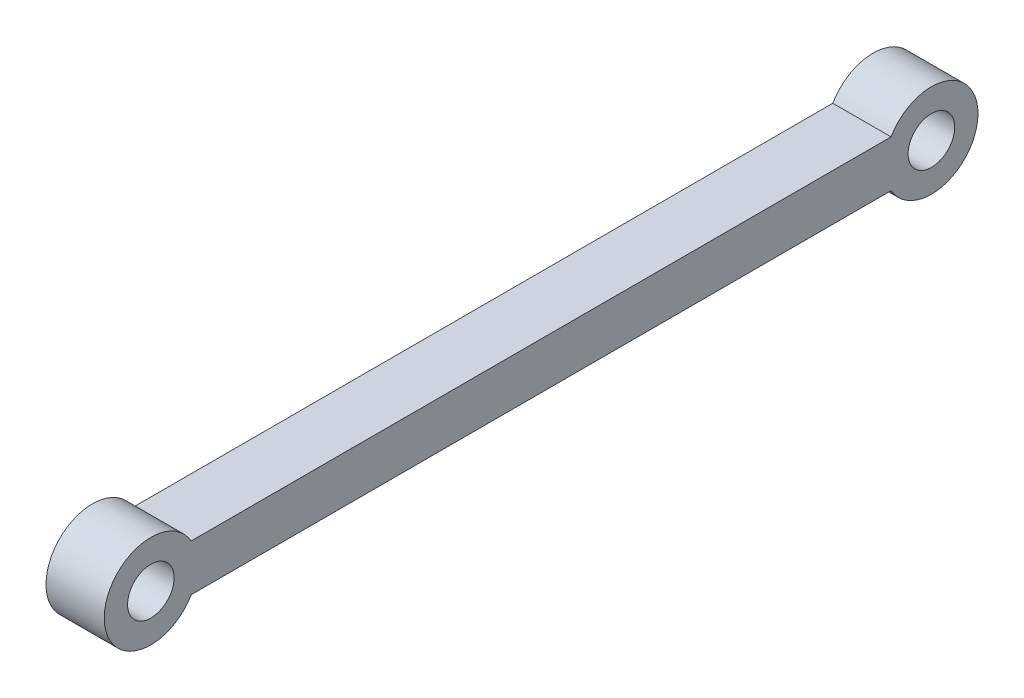
ISO-10303-21;
HEADER;
FILE_DESCRIPTION(('STEP AP214'),'2;1');
FILE_NAME('part.step','',(''),(''),'','','');
FILE_SCHEMA(('AUTOMOTIVE_DESIGN { 1 0 10303 214 1 1 1 1 }'));
ENDSEC;
DATA;
#1=APPLICATION_CONTEXT('core data for automotive mechanical design processes');
#2=APPLICATION_PROTOCOL_DEFINITION('international standard','automotive_design',2000,#1);
#3=PRODUCT_CONTEXT('',#1,'mechanical');
#4=PRODUCT('Part','Part','',(#3));
#5=PRODUCT_RELATED_PRODUCT_CATEGORY('part','',(#4));
#6=PRODUCT_DEFINITION_FORMATION('','',#4);
#7=PRODUCT_DEFINITION_CONTEXT('part definition',#1,'design');
#8=PRODUCT_DEFINITION('design','',#6,#7);
#9=PRODUCT_DEFINITION_SHAPE('','',#8);
#10=(LENGTH_UNIT() NAMED_UNIT(*) SI_UNIT(.MILLI.,.METRE.));
#11=(NAMED_UNIT(*) PLANE_ANGLE_UNIT() SI_UNIT($,.RADIAN.));
#12=(NAMED_UNIT(*) SI_UNIT($,.STERADIAN.) SOLID_ANGLE_UNIT());
#13=UNCERTAINTY_MEASURE_WITH_UNIT(LENGTH_MEASURE(1.E-05),#10,'distance_accuracy_value','');
#14=(GEOMETRIC_REPRESENTATION_CONTEXT(3) GLOBAL_UNCERTAINTY_ASSIGNED_CONTEXT((#13)) GLOBAL_UNIT_ASSIGNED_CONTEXT((#10,
#11,#12)) REPRESENTATION_CONTEXT('',''));
#15=CARTESIAN_POINT('',(0.,0.,0.));
#16=DIRECTION('',(0.,0.,1.));
#17=DIRECTION('',(1.,0.,0.));
#18=AXIS2_PLACEMENT_3D('',#15,#16,#17);
#19=CARTESIAN_POINT('',(1.25,-1.,-16.75));
#20=DIRECTION('',(1.,0.,0.));
#21=DIRECTION('',(0.,0.,-1.));
#22=AXIS2_PLACEMENT_3D('',#19,#20,#21);
#23=PLANE('',#22);
#24=CARTESIAN_POINT('',(1.25,-1.,16.75));
#25=DIRECTION('',(1.,0.,0.));
#26=DIRECTION('',(0.,0.,-1.));
#27=AXIS2_PLACEMENT_3D('',#24,#25,#26);
#28=CIRCLE('',#27,1.);
#29=CARTESIAN_POINT('',(1.25,-1.,15.75));
#30=VERTEX_POINT('',#29);
#31=EDGE_CURVE('E108',#30,#30,#28,.T.);
#32=ORIENTED_EDGE('',*,*,#31,.F.);
#33=EDGE_LOOP('',(#32));
#34=FACE_BOUND('',#33,.T.);
#35=CARTESIAN_POINT('',(1.25,-1.,-16.75));
#36=DIRECTION('',(1.,0.,0.));
#37=DIRECTION('',(0.,0.,-1.));
#38=AXIS2_PLACEMENT_3D('',#35,#36,#37);
#39=CIRCLE('',#38,2.);
#40=CARTESIAN_POINT('',(1.25,-2.,-15.0179491924311));
#41=VERTEX_POINT('',#40);
#42=CARTESIAN_POINT('',(1.25,0.,-15.0179491924311));
#43=VERTEX_POINT('',#42);
#44=EDGE_CURVE('E93',#41,#43,#39,.T.);
#45=ORIENTED_EDGE('',*,*,#44,.T.);
#46=DIRECTION('',(0.,0.,1.));
#47=VECTOR('',#46,1.);
#48=CARTESIAN_POINT('',(1.25,0.,15.0179491924311));
#49=LINE('',#48,#47);
#50=CARTESIAN_POINT('',(1.25,0.,15.0179491924311));
#51=VERTEX_POINT('',#50);
#52=EDGE_CURVE('E88',#43,#51,#49,.T.);
#53=ORIENTED_EDGE('',*,*,#52,.T.);
#54=CARTESIAN_POINT('',(1.25,-1.,16.75));
#55=DIRECTION('',(1.,0.,0.));
#56=DIRECTION('',(0.,0.,-1.));
#57=AXIS2_PLACEMENT_3D('',#54,#55,#56);
#58=CIRCLE('',#57,2.);
#59=CARTESIAN_POINT('',(1.25,-2.,15.0179491924311));
#60=VERTEX_POINT('',#59);
#61=EDGE_CURVE('E91',#51,#60,#58,.T.);
#62=ORIENTED_EDGE('',*,*,#61,.T.);
#63=DIRECTION('',(0.,0.,-1.));
#64=VECTOR('',#63,1.);
#65=CARTESIAN_POINT('',(1.25,-2.,15.0179491924311));
#66=LINE('',#65,#64);
#67=EDGE_CURVE('E58',#60,#41,#66,.T.);
#68=ORIENTED_EDGE('',*,*,#67,.T.);
#69=EDGE_LOOP('',(#45,#53,#62,#68));
#70=FACE_BOUND('',#69,.T.);
#71=CARTESIAN_POINT('',(1.25,-1.,-16.75));
#72=DIRECTION('',(1.,0.,0.));
#73=DIRECTION('',(0.,0.,-1.));
#74=AXIS2_PLACEMENT_3D('',#71,#72,#73);
#75=CIRCLE('',#74,1.00000000000001);
#76=CARTESIAN_POINT('',(1.25,-1.,-17.75));
#77=VERTEX_POINT('',#76);
#78=EDGE_CURVE('E123',#77,#77,#75,.T.);
#79=ORIENTED_EDGE('',*,*,#78,.F.);
#80=EDGE_LOOP('',(#79));
#81=FACE_BOUND('',#80,.T.);
#82=ADVANCED_FACE('F41',(#34,#70,#81),#23,.T.);
#83=CARTESIAN_POINT('',(-1.25,-1.,-16.75));
#84=DIRECTION('',(1.,0.,0.));
#85=DIRECTION('',(0.,0.,-1.));
#86=AXIS2_PLACEMENT_3D('',#83,#84,#85);
#87=PLANE('',#86);
#88=CARTESIAN_POINT('',(-1.25,-1.,-16.75));
#89=DIRECTION('',(1.,0.,0.));
#90=DIRECTION('',(0.,0.,-1.));
#91=AXIS2_PLACEMENT_3D('',#88,#89,#90);
#92=CIRCLE('',#91,2.);
#93=CARTESIAN_POINT('',(-1.25,-2.,-15.0179491924311));
#94=VERTEX_POINT('',#93);
#95=CARTESIAN_POINT('',(-1.25,0.,-15.0179491924311));
#96=VERTEX_POINT('',#95);
#97=EDGE_CURVE('E105',#94,#96,#92,.T.);
#98=ORIENTED_EDGE('',*,*,#97,.F.);
#99=DIRECTION('',(0.,0.,-1.));
#100=VECTOR('',#99,1.);
#101=CARTESIAN_POINT('',(-1.25,-2.,15.0179491924311));
#102=LINE('',#101,#100);
#103=CARTESIAN_POINT('',(-1.25,-2.,15.0179491924311));
#104=VERTEX_POINT('',#103);
#105=EDGE_CURVE('E81',#104,#94,#102,.T.);
#106=ORIENTED_EDGE('',*,*,#105,.F.);
#107=CARTESIAN_POINT('',(-1.25,-1.,16.75));
#108=DIRECTION('',(1.,0.,0.));
#109=DIRECTION('',(0.,0.,-1.));
#110=AXIS2_PLACEMENT_3D('',#107,#108,#109);
#111=CIRCLE('',#110,2.);
#112=CARTESIAN_POINT('',(-1.25,0.,15.0179491924311));
#113=VERTEX_POINT('',#112);
#114=EDGE_CURVE('E75',#113,#104,#111,.T.);
#115=ORIENTED_EDGE('',*,*,#114,.F.);
#116=DIRECTION('',(0.,0.,1.));
#117=VECTOR('',#116,1.);
#118=CARTESIAN_POINT('',(-1.25,0.,15.0179491924311));
#119=LINE('',#118,#117);
#120=EDGE_CURVE('E97',#96,#113,#119,.T.);
#121=ORIENTED_EDGE('',*,*,#120,.F.);
#122=EDGE_LOOP('',(#98,#106,#115,#121));
#123=FACE_BOUND('',#122,.T.);
#124=CARTESIAN_POINT('',(-1.25,-1.,16.75));
#125=DIRECTION('',(1.,0.,0.));
#126=DIRECTION('',(0.,0.,-1.));
#127=AXIS2_PLACEMENT_3D('',#124,#125,#126);
#128=CIRCLE('',#127,1.);
#129=CARTESIAN_POINT('',(-1.25,-1.,15.75));
#130=VERTEX_POINT('',#129);
#131=EDGE_CURVE('E120',#130,#130,#128,.T.);
#132=ORIENTED_EDGE('',*,*,#131,.T.);
#133=EDGE_LOOP('',(#132));
#134=FACE_BOUND('',#133,.T.);
#135=CARTESIAN_POINT('',(-1.25,-1.,-16.75));
#136=DIRECTION('',(1.,0.,0.));
#137=DIRECTION('',(0.,0.,-1.));
#138=AXIS2_PLACEMENT_3D('',#135,#136,#137);
#139=CIRCLE('',#138,1.00000000000001);
#140=CARTESIAN_POINT('',(-1.25,-1.,-17.75));
#141=VERTEX_POINT('',#140);
#142=EDGE_CURVE('E126',#141,#141,#139,.T.);
#143=ORIENTED_EDGE('',*,*,#142,.T.);
#144=EDGE_LOOP('',(#143));
#145=FACE_BOUND('',#144,.T.);
#146=ADVANCED_FACE('F116',(#123,#134,#145),#87,.F.);
#147=CARTESIAN_POINT('',(1.25,-1.,-16.75));
#148=DIRECTION('',(-1.,0.,0.));
#149=DIRECTION('',(0.,0.,1.));
#150=AXIS2_PLACEMENT_3D('',#147,#148,#149);
#151=CYLINDRICAL_SURFACE('',#150,2.);
#152=ORIENTED_EDGE('',*,*,#97,.T.);
#153=DIRECTION('',(-1.,0.,0.));
#154=VECTOR('',#153,1.);
#155=CARTESIAN_POINT('',(1.25,0.,-15.0179491924311));
#156=LINE('',#155,#154);
#157=EDGE_CURVE('E11',#43,#96,#156,.T.);
#158=ORIENTED_EDGE('',*,*,#157,.F.);
#159=ORIENTED_EDGE('',*,*,#44,.F.);
#160=DIRECTION('',(-1.,0.,0.));
#161=VECTOR('',#160,1.);
#162=CARTESIAN_POINT('',(1.25,-2.,-15.0179491924311));
#163=LINE('',#162,#161);
#164=EDGE_CURVE('E101',#41,#94,#163,.T.);
#165=ORIENTED_EDGE('',*,*,#164,.T.);
#166=EDGE_LOOP('',(#152,#158,#159,#165));
#167=FACE_BOUND('',#166,.T.);
#168=ADVANCED_FACE('F43',(#167),#151,.T.);
#169=CARTESIAN_POINT('',(1.25,0.,15.0179491924311));
#170=DIRECTION('',(0.,-1.,0.));
#171=DIRECTION('',(0.,0.,-1.));
#172=AXIS2_PLACEMENT_3D('',#169,#170,#171);
#173=PLANE('',#172);
#174=ORIENTED_EDGE('',*,*,#120,.T.);
#175=DIRECTION('',(-1.,0.,0.));
#176=VECTOR('',#175,1.);
#177=CARTESIAN_POINT('',(1.25,0.,15.0179491924311));
#178=LINE('',#177,#176);
#179=EDGE_CURVE('E50',#51,#113,#178,.T.);
#180=ORIENTED_EDGE('',*,*,#179,.F.);
#181=ORIENTED_EDGE('',*,*,#52,.F.);
#182=ORIENTED_EDGE('',*,*,#157,.T.);
#183=EDGE_LOOP('',(#174,#180,#181,#182));
#184=FACE_BOUND('',#183,.T.);
#185=ADVANCED_FACE('F96',(#184),#173,.F.);
#186=CARTESIAN_POINT('',(1.25,-1.,16.75));
#187=DIRECTION('',(-1.,0.,0.));
#188=DIRECTION('',(0.,0.,1.));
#189=AXIS2_PLACEMENT_3D('',#186,#187,#188);
#190=CYLINDRICAL_SURFACE('',#189,2.);
#191=ORIENTED_EDGE('',*,*,#114,.T.);
#192=DIRECTION('',(-1.,0.,0.));
#193=VECTOR('',#192,1.);
#194=CARTESIAN_POINT('',(1.25,-2.,15.0179491924311));
#195=LINE('',#194,#193);
#196=EDGE_CURVE('E98',#60,#104,#195,.T.);
#197=ORIENTED_EDGE('',*,*,#196,.F.);
#198=ORIENTED_EDGE('',*,*,#61,.F.);
#199=ORIENTED_EDGE('',*,*,#179,.T.);
#200=EDGE_LOOP('',(#191,#197,#198,#199));
#201=FACE_BOUND('',#200,.T.);
#202=ADVANCED_FACE('F99',(#201),#190,.T.);
#203=CARTESIAN_POINT('',(1.25,-2.,15.0179491924311));
#204=DIRECTION('',(0.,1.,0.));
#205=DIRECTION('',(0.,0.,1.));
#206=AXIS2_PLACEMENT_3D('',#203,#204,#205);
#207=PLANE('',#206);
#208=ORIENTED_EDGE('',*,*,#105,.T.);
#209=ORIENTED_EDGE('',*,*,#164,.F.);
#210=ORIENTED_EDGE('',*,*,#67,.F.);
#211=ORIENTED_EDGE('',*,*,#196,.T.);
#212=EDGE_LOOP('',(#208,#209,#210,#211));
#213=FACE_BOUND('',#212,.T.);
#214=ADVANCED_FACE('F113',(#213),#207,.F.);
#215=CARTESIAN_POINT('',(1.25,-1.,16.75));
#216=DIRECTION('',(-1.,0.,0.));
#217=DIRECTION('',(0.,0.,1.));
#218=AXIS2_PLACEMENT_3D('',#215,#216,#217);
#219=CYLINDRICAL_SURFACE('',#218,1.);
#220=ORIENTED_EDGE('',*,*,#31,.T.);
#221=EDGE_LOOP('',(#220));
#222=FACE_BOUND('',#221,.T.);
#223=ORIENTED_EDGE('',*,*,#131,.F.);
#224=EDGE_LOOP('',(#223));
#225=FACE_BOUND('',#224,.T.);
#226=ADVANCED_FACE('F143',(#222,#225),#219,.F.);
#227=CARTESIAN_POINT('',(1.25,-1.,-16.75));
#228=DIRECTION('',(-1.,0.,0.));
#229=DIRECTION('',(0.,0.,1.));
#230=AXIS2_PLACEMENT_3D('',#227,#228,#229);
#231=CYLINDRICAL_SURFACE('',#230,1.00000000000001);
#232=ORIENTED_EDGE('',*,*,#78,.T.);
#233=EDGE_LOOP('',(#232));
#234=FACE_BOUND('',#233,.T.);
#235=ORIENTED_EDGE('',*,*,#142,.F.);
#236=EDGE_LOOP('',(#235));
#237=FACE_BOUND('',#236,.T.);
#238=ADVANCED_FACE('F132',(#234,#237),#231,.F.);
#239=CLOSED_SHELL('',(#82,#146,#168,#185,#202,#214,#226,#238));
#240=MANIFOLD_SOLID_BREP('B2',#239);
#241=ADVANCED_BREP_SHAPE_REPRESENTATION('',(#18,#240),#14);
#242=SHAPE_DEFINITION_REPRESENTATION(#9,#241);
ENDSEC;
END-ISO-10303-21;
